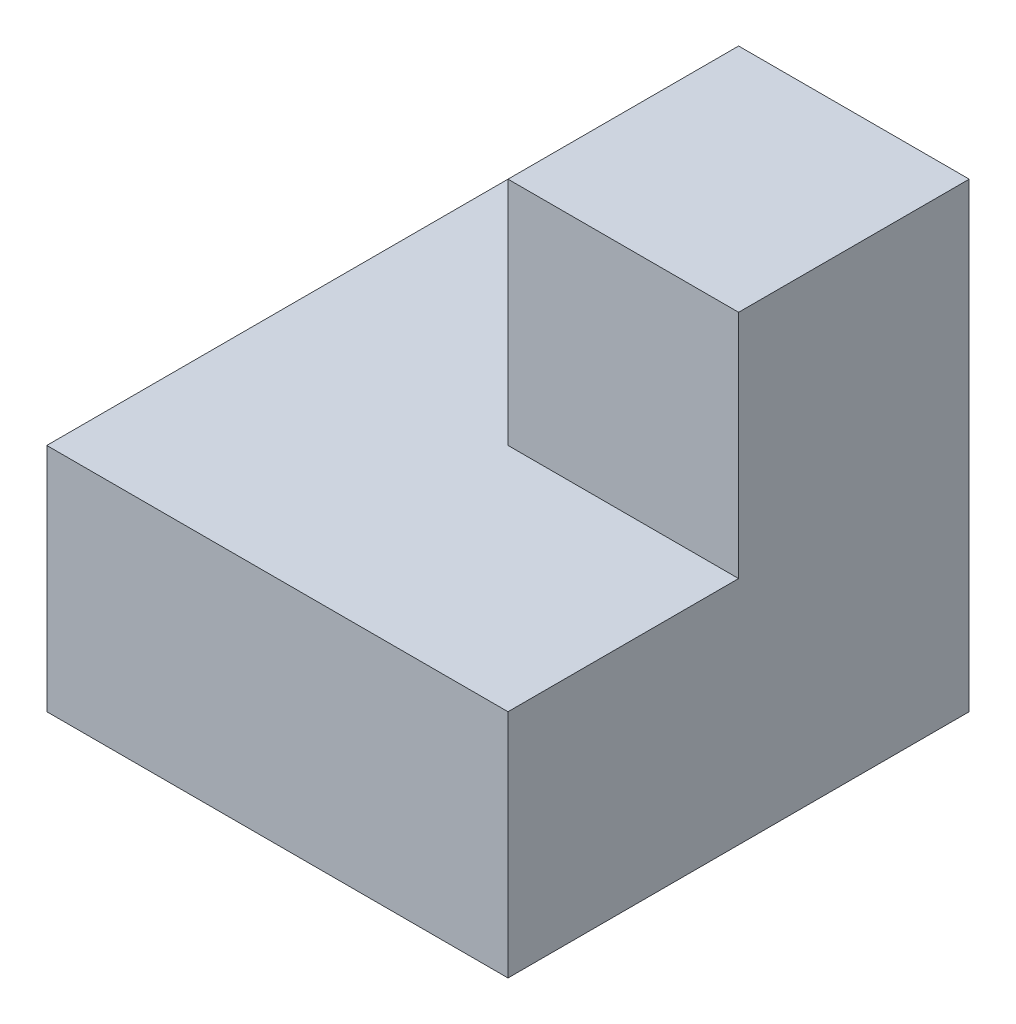
ISO-10303-21;
HEADER;
FILE_DESCRIPTION(('STEP AP214'),'2;1');
FILE_NAME('part.step','',(''),(''),'','','');
FILE_SCHEMA(('AUTOMOTIVE_DESIGN { 1 0 10303 214 1 1 1 1 }'));
ENDSEC;
DATA;
#1=APPLICATION_CONTEXT('core data for automotive mechanical design processes');
#2=APPLICATION_PROTOCOL_DEFINITION('international standard','automotive_design',2000,#1);
#3=PRODUCT_CONTEXT('',#1,'mechanical');
#4=PRODUCT('Part','Part','',(#3));
#5=PRODUCT_RELATED_PRODUCT_CATEGORY('part','',(#4));
#6=PRODUCT_DEFINITION_FORMATION('','',#4);
#7=PRODUCT_DEFINITION_CONTEXT('part definition',#1,'design');
#8=PRODUCT_DEFINITION('design','',#6,#7);
#9=PRODUCT_DEFINITION_SHAPE('','',#8);
#10=(LENGTH_UNIT() NAMED_UNIT(*) SI_UNIT(.MILLI.,.METRE.));
#11=(NAMED_UNIT(*) PLANE_ANGLE_UNIT() SI_UNIT($,.RADIAN.));
#12=(NAMED_UNIT(*) SI_UNIT($,.STERADIAN.) SOLID_ANGLE_UNIT());
#13=UNCERTAINTY_MEASURE_WITH_UNIT(LENGTH_MEASURE(1.E-05),#10,'distance_accuracy_value','');
#14=(GEOMETRIC_REPRESENTATION_CONTEXT(3) GLOBAL_UNCERTAINTY_ASSIGNED_CONTEXT((#13)) GLOBAL_UNIT_ASSIGNED_CONTEXT((#10,
#11,#12)) REPRESENTATION_CONTEXT('',''));
#15=CARTESIAN_POINT('',(0.,0.,0.));
#16=DIRECTION('',(0.,0.,1.));
#17=DIRECTION('',(1.,0.,0.));
#18=AXIS2_PLACEMENT_3D('',#15,#16,#17);
#19=CARTESIAN_POINT('',(0.,4.,0.));
#20=DIRECTION('',(1.,0.,0.));
#21=DIRECTION('',(0.,0.,-1.));
#22=AXIS2_PLACEMENT_3D('',#19,#20,#21);
#23=PLANE('',#22);
#24=DIRECTION('',(0.,0.,1.));
#25=VECTOR('',#24,1.);
#26=CARTESIAN_POINT('',(0.,2.,0.));
#27=LINE('',#26,#25);
#28=CARTESIAN_POINT('',(0.,2.,-4.));
#29=VERTEX_POINT('',#28);
#30=CARTESIAN_POINT('',(0.,2.,0.));
#31=VERTEX_POINT('',#30);
#32=EDGE_CURVE('E118',#29,#31,#27,.T.);
#33=ORIENTED_EDGE('',*,*,#32,.F.);
#34=DIRECTION('',(0.,-1.,0.));
#35=VECTOR('',#34,1.);
#36=CARTESIAN_POINT('',(0.,4.,-4.));
#37=LINE('',#36,#35);
#38=CARTESIAN_POINT('',(0.,0.,-4.));
#39=VERTEX_POINT('',#38);
#40=EDGE_CURVE('E93',#29,#39,#37,.T.);
#41=ORIENTED_EDGE('',*,*,#40,.T.);
#42=DIRECTION('',(0.,0.,1.));
#43=VECTOR('',#42,1.);
#44=CARTESIAN_POINT('',(0.,0.,0.));
#45=LINE('',#44,#43);
#46=CARTESIAN_POINT('',(0.,0.,0.));
#47=VERTEX_POINT('',#46);
#48=EDGE_CURVE('E97',#39,#47,#45,.T.);
#49=ORIENTED_EDGE('',*,*,#48,.T.);
#50=DIRECTION('',(0.,-1.,0.));
#51=VECTOR('',#50,1.);
#52=CARTESIAN_POINT('',(0.,4.,0.));
#53=LINE('',#52,#51);
#54=EDGE_CURVE('E11',#31,#47,#53,.T.);
#55=ORIENTED_EDGE('',*,*,#54,.F.);
#56=EDGE_LOOP('',(#33,#41,#49,#55));
#57=FACE_BOUND('',#56,.T.);
#58=ADVANCED_FACE('F33',(#57),#23,.F.);
#59=CARTESIAN_POINT('',(0.,4.,0.));
#60=DIRECTION('',(0.,0.,-1.));
#61=DIRECTION('',(-1.,0.,0.));
#62=AXIS2_PLACEMENT_3D('',#59,#60,#61);
#63=PLANE('',#62);
#64=DIRECTION('',(1.,0.,0.));
#65=VECTOR('',#64,1.);
#66=CARTESIAN_POINT('',(0.,2.,0.));
#67=LINE('',#66,#65);
#68=CARTESIAN_POINT('',(4.,2.,0.));
#69=VERTEX_POINT('',#68);
#70=EDGE_CURVE('E150',#31,#69,#67,.T.);
#71=ORIENTED_EDGE('',*,*,#70,.F.);
#72=ORIENTED_EDGE('',*,*,#54,.T.);
#73=DIRECTION('',(1.,0.,0.));
#74=VECTOR('',#73,1.);
#75=CARTESIAN_POINT('',(0.,0.,0.));
#76=LINE('',#75,#74);
#77=CARTESIAN_POINT('',(4.,0.,0.));
#78=VERTEX_POINT('',#77);
#79=EDGE_CURVE('E84',#47,#78,#76,.T.);
#80=ORIENTED_EDGE('',*,*,#79,.T.);
#81=DIRECTION('',(0.,-1.,0.));
#82=VECTOR('',#81,1.);
#83=CARTESIAN_POINT('',(4.,4.,0.));
#84=LINE('',#83,#82);
#85=EDGE_CURVE('E40',#69,#78,#84,.T.);
#86=ORIENTED_EDGE('',*,*,#85,.F.);
#87=EDGE_LOOP('',(#71,#72,#80,#86));
#88=FACE_BOUND('',#87,.T.);
#89=ADVANCED_FACE('F112',(#88),#63,.F.);
#90=CARTESIAN_POINT('',(0.,4.,-4.));
#91=DIRECTION('',(0.,0.,1.));
#92=DIRECTION('',(1.,0.,0.));
#93=AXIS2_PLACEMENT_3D('',#90,#91,#92);
#94=PLANE('',#93);
#95=DIRECTION('',(0.,1.,0.));
#96=VECTOR('',#95,1.);
#97=CARTESIAN_POINT('',(2.,2.,-4.));
#98=LINE('',#97,#96);
#99=CARTESIAN_POINT('',(2.,2.,-4.));
#100=VERTEX_POINT('',#99);
#101=CARTESIAN_POINT('',(2.,4.,-4.));
#102=VERTEX_POINT('',#101);
#103=EDGE_CURVE('E138',#100,#102,#98,.T.);
#104=ORIENTED_EDGE('',*,*,#103,.T.);
#105=DIRECTION('',(-1.,0.,0.));
#106=VECTOR('',#105,1.);
#107=CARTESIAN_POINT('',(0.,4.,-4.));
#108=LINE('',#107,#106);
#109=CARTESIAN_POINT('',(4.,4.,-4.));
#110=VERTEX_POINT('',#109);
#111=EDGE_CURVE('E92',#110,#102,#108,.T.);
#112=ORIENTED_EDGE('',*,*,#111,.F.);
#113=DIRECTION('',(0.,-1.,0.));
#114=VECTOR('',#113,1.);
#115=CARTESIAN_POINT('',(4.,4.,-4.));
#116=LINE('',#115,#114);
#117=CARTESIAN_POINT('',(4.,0.,-4.));
#118=VERTEX_POINT('',#117);
#119=EDGE_CURVE('E75',#110,#118,#116,.T.);
#120=ORIENTED_EDGE('',*,*,#119,.T.);
#121=DIRECTION('',(-1.,0.,0.));
#122=VECTOR('',#121,1.);
#123=CARTESIAN_POINT('',(0.,0.,-4.));
#124=LINE('',#123,#122);
#125=EDGE_CURVE('E83',#118,#39,#124,.T.);
#126=ORIENTED_EDGE('',*,*,#125,.T.);
#127=ORIENTED_EDGE('',*,*,#40,.F.);
#128=DIRECTION('',(-1.,0.,0.));
#129=VECTOR('',#128,1.);
#130=CARTESIAN_POINT('',(0.,2.,-4.));
#131=LINE('',#130,#129);
#132=EDGE_CURVE('E146',#100,#29,#131,.T.);
#133=ORIENTED_EDGE('',*,*,#132,.F.);
#134=EDGE_LOOP('',(#104,#112,#120,#126,#127,#133));
#135=FACE_BOUND('',#134,.T.);
#136=ADVANCED_FACE('F89',(#135),#94,.F.);
#137=CARTESIAN_POINT('',(0.,4.,0.));
#138=DIRECTION('',(0.,-1.,0.));
#139=DIRECTION('',(0.,0.,-1.));
#140=AXIS2_PLACEMENT_3D('',#137,#138,#139);
#141=PLANE('',#140);
#142=DIRECTION('',(0.,0.,1.));
#143=VECTOR('',#142,1.);
#144=CARTESIAN_POINT('',(2.,4.,0.));
#145=LINE('',#144,#143);
#146=CARTESIAN_POINT('',(2.,4.,-2.));
#147=VERTEX_POINT('',#146);
#148=EDGE_CURVE('E136',#102,#147,#145,.T.);
#149=ORIENTED_EDGE('',*,*,#148,.T.);
#150=DIRECTION('',(-1.,0.,0.));
#151=VECTOR('',#150,1.);
#152=CARTESIAN_POINT('',(0.,4.,-2.));
#153=LINE('',#152,#151);
#154=CARTESIAN_POINT('',(4.,4.,-2.));
#155=VERTEX_POINT('',#154);
#156=EDGE_CURVE('E147',#155,#147,#153,.T.);
#157=ORIENTED_EDGE('',*,*,#156,.F.);
#158=DIRECTION('',(0.,0.,-1.));
#159=VECTOR('',#158,1.);
#160=CARTESIAN_POINT('',(4.,4.,0.));
#161=LINE('',#160,#159);
#162=EDGE_CURVE('E55',#155,#110,#161,.T.);
#163=ORIENTED_EDGE('',*,*,#162,.T.);
#164=ORIENTED_EDGE('',*,*,#111,.T.);
#165=EDGE_LOOP('',(#149,#157,#163,#164));
#166=FACE_BOUND('',#165,.T.);
#167=ADVANCED_FACE('F161',(#166),#141,.F.);
#168=CARTESIAN_POINT('',(4.,4.,0.));
#169=DIRECTION('',(-1.,0.,0.));
#170=DIRECTION('',(0.,0.,1.));
#171=AXIS2_PLACEMENT_3D('',#168,#169,#170);
#172=PLANE('',#171);
#173=ORIENTED_EDGE('',*,*,#162,.F.);
#174=DIRECTION('',(0.,1.,0.));
#175=VECTOR('',#174,1.);
#176=CARTESIAN_POINT('',(4.,2.,-2.));
#177=LINE('',#176,#175);
#178=CARTESIAN_POINT('',(4.,2.,-2.));
#179=VERTEX_POINT('',#178);
#180=EDGE_CURVE('E47',#179,#155,#177,.T.);
#181=ORIENTED_EDGE('',*,*,#180,.F.);
#182=DIRECTION('',(0.,0.,-1.));
#183=VECTOR('',#182,1.);
#184=CARTESIAN_POINT('',(4.,2.,0.));
#185=LINE('',#184,#183);
#186=EDGE_CURVE('E154',#69,#179,#185,.T.);
#187=ORIENTED_EDGE('',*,*,#186,.F.);
#188=ORIENTED_EDGE('',*,*,#85,.T.);
#189=DIRECTION('',(0.,0.,-1.));
#190=VECTOR('',#189,1.);
#191=CARTESIAN_POINT('',(4.,0.,0.));
#192=LINE('',#191,#190);
#193=EDGE_CURVE('E72',#78,#118,#192,.T.);
#194=ORIENTED_EDGE('',*,*,#193,.T.);
#195=ORIENTED_EDGE('',*,*,#119,.F.);
#196=EDGE_LOOP('',(#173,#181,#187,#188,#194,#195));
#197=FACE_BOUND('',#196,.T.);
#198=ADVANCED_FACE('F74',(#197),#172,.F.);
#199=CARTESIAN_POINT('',(0.,0.,0.));
#200=DIRECTION('',(0.,-1.,0.));
#201=DIRECTION('',(0.,0.,-1.));
#202=AXIS2_PLACEMENT_3D('',#199,#200,#201);
#203=PLANE('',#202);
#204=ORIENTED_EDGE('',*,*,#48,.F.);
#205=ORIENTED_EDGE('',*,*,#125,.F.);
#206=ORIENTED_EDGE('',*,*,#193,.F.);
#207=ORIENTED_EDGE('',*,*,#79,.F.);
#208=EDGE_LOOP('',(#204,#205,#206,#207));
#209=FACE_BOUND('',#208,.T.);
#210=ADVANCED_FACE('F95',(#209),#203,.T.);
#211=CARTESIAN_POINT('',(2.,2.,0.));
#212=DIRECTION('',(-1.,0.,0.));
#213=DIRECTION('',(0.,0.,1.));
#214=AXIS2_PLACEMENT_3D('',#211,#212,#213);
#215=PLANE('',#214);
#216=ORIENTED_EDGE('',*,*,#148,.F.);
#217=ORIENTED_EDGE('',*,*,#103,.F.);
#218=DIRECTION('',(0.,0.,1.));
#219=VECTOR('',#218,1.);
#220=CARTESIAN_POINT('',(2.,2.,0.));
#221=LINE('',#220,#219);
#222=CARTESIAN_POINT('',(2.,2.,-2.));
#223=VERTEX_POINT('',#222);
#224=EDGE_CURVE('E141',#100,#223,#221,.T.);
#225=ORIENTED_EDGE('',*,*,#224,.T.);
#226=DIRECTION('',(0.,1.,0.));
#227=VECTOR('',#226,1.);
#228=CARTESIAN_POINT('',(2.,2.,-2.));
#229=LINE('',#228,#227);
#230=EDGE_CURVE('E109',#223,#147,#229,.T.);
#231=ORIENTED_EDGE('',*,*,#230,.T.);
#232=EDGE_LOOP('',(#216,#217,#225,#231));
#233=FACE_BOUND('',#232,.T.);
#234=ADVANCED_FACE('F140',(#233),#215,.T.);
#235=CARTESIAN_POINT('',(0.,2.,-2.));
#236=DIRECTION('',(0.,0.,-1.));
#237=DIRECTION('',(-1.,0.,0.));
#238=AXIS2_PLACEMENT_3D('',#235,#236,#237);
#239=PLANE('',#238);
#240=ORIENTED_EDGE('',*,*,#156,.T.);
#241=ORIENTED_EDGE('',*,*,#230,.F.);
#242=DIRECTION('',(-1.,0.,0.));
#243=VECTOR('',#242,1.);
#244=CARTESIAN_POINT('',(0.,2.,-2.));
#245=LINE('',#244,#243);
#246=EDGE_CURVE('E143',#179,#223,#245,.T.);
#247=ORIENTED_EDGE('',*,*,#246,.F.);
#248=ORIENTED_EDGE('',*,*,#180,.T.);
#249=EDGE_LOOP('',(#240,#241,#247,#248));
#250=FACE_BOUND('',#249,.T.);
#251=ADVANCED_FACE('F160',(#250),#239,.F.);
#252=CARTESIAN_POINT('',(0.,2.,0.));
#253=DIRECTION('',(0.,1.,0.));
#254=DIRECTION('',(0.,0.,1.));
#255=AXIS2_PLACEMENT_3D('',#252,#253,#254);
#256=PLANE('',#255);
#257=ORIENTED_EDGE('',*,*,#224,.F.);
#258=ORIENTED_EDGE('',*,*,#132,.T.);
#259=ORIENTED_EDGE('',*,*,#32,.T.);
#260=ORIENTED_EDGE('',*,*,#70,.T.);
#261=ORIENTED_EDGE('',*,*,#186,.T.);
#262=ORIENTED_EDGE('',*,*,#246,.T.);
#263=EDGE_LOOP('',(#257,#258,#259,#260,#261,#262));
#264=FACE_BOUND('',#263,.T.);
#265=ADVANCED_FACE('F145',(#264),#256,.T.);
#266=CLOSED_SHELL('',(#58,#89,#136,#167,#198,#210,#234,#251,#265));
#267=MANIFOLD_SOLID_BREP('B2',#266);
#268=ADVANCED_BREP_SHAPE_REPRESENTATION('',(#18,#267),#14);
#269=SHAPE_DEFINITION_REPRESENTATION(#9,#268);
ENDSEC;
END-ISO-10303-21;
